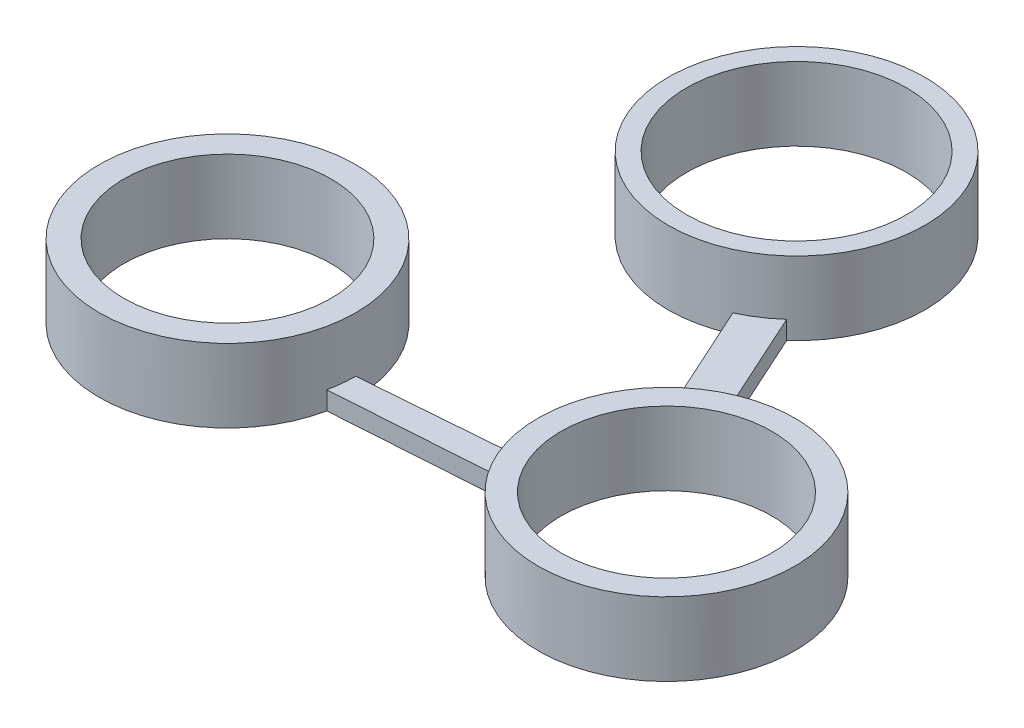
ISO-10303-21;
HEADER;
FILE_DESCRIPTION(('STEP AP214'),'2;1');
FILE_NAME('part.step','',(''),(''),'','','');
FILE_SCHEMA(('AUTOMOTIVE_DESIGN { 1 0 10303 214 1 1 1 1 }'));
ENDSEC;
DATA;
#1=APPLICATION_CONTEXT('core data for automotive mechanical design processes');
#2=APPLICATION_PROTOCOL_DEFINITION('international standard','automotive_design',2000,#1);
#3=PRODUCT_CONTEXT('',#1,'mechanical');
#4=PRODUCT('Part','Part','',(#3));
#5=PRODUCT_RELATED_PRODUCT_CATEGORY('part','',(#4));
#6=PRODUCT_DEFINITION_FORMATION('','',#4);
#7=PRODUCT_DEFINITION_CONTEXT('part definition',#1,'design');
#8=PRODUCT_DEFINITION('design','',#6,#7);
#9=PRODUCT_DEFINITION_SHAPE('','',#8);
#10=(LENGTH_UNIT() NAMED_UNIT(*) SI_UNIT(.MILLI.,.METRE.));
#11=(NAMED_UNIT(*) PLANE_ANGLE_UNIT() SI_UNIT($,.RADIAN.));
#12=(NAMED_UNIT(*) SI_UNIT($,.STERADIAN.) SOLID_ANGLE_UNIT());
#13=UNCERTAINTY_MEASURE_WITH_UNIT(LENGTH_MEASURE(1.E-05),#10,'distance_accuracy_value','');
#14=(GEOMETRIC_REPRESENTATION_CONTEXT(3) GLOBAL_UNCERTAINTY_ASSIGNED_CONTEXT((#13)) GLOBAL_UNIT_ASSIGNED_CONTEXT((#10,
#11,#12)) REPRESENTATION_CONTEXT('',''));
#15=CARTESIAN_POINT('',(0.,0.,0.));
#16=DIRECTION('',(0.,0.,1.));
#17=DIRECTION('',(1.,0.,0.));
#18=AXIS2_PLACEMENT_3D('',#15,#16,#17);
#19=CARTESIAN_POINT('',(0.,1.,0.));
#20=DIRECTION('',(0.,1.,0.));
#21=DIRECTION('',(0.,0.,1.));
#22=AXIS2_PLACEMENT_3D('',#19,#20,#21);
#23=PLANE('',#22);
#24=DIRECTION('',(-0.414033780774487,0.,-0.910261516476218));
#25=VECTOR('',#24,1.);
#26=CARTESIAN_POINT('',(-53.5880387248046,1.,-49.7512375078401));
#27=LINE('',#26,#25);
#28=CARTESIAN_POINT('',(-53.7338041530761,1.,-50.0717057062079));
#29=VERTEX_POINT('',#28);
#30=CARTESIAN_POINT('',(-57.6700518999493,1.,-58.7256248057379));
#31=VERTEX_POINT('',#30);
#32=EDGE_CURVE('E107',#29,#31,#27,.T.);
#33=ORIENTED_EDGE('',*,*,#32,.T.);
#34=CARTESIAN_POINT('',(-62.3410024051966,1.,-63.9392820036682));
#35=DIRECTION('',(0.,1.,0.));
#36=DIRECTION('',(0.,0.,1.));
#37=AXIS2_PLACEMENT_3D('',#34,#35,#36);
#38=CIRCLE('',#37,7.);
#39=CARTESIAN_POINT('',(-59.4427659397752,1.,-57.5674513883346));
#40=VERTEX_POINT('',#39);
#41=EDGE_CURVE('E101',#31,#40,#38,.F.);
#42=ORIENTED_EDGE('',*,*,#41,.T.);
#43=DIRECTION('',(0.414033780774487,0.,0.910261516476218));
#44=VECTOR('',#43,1.);
#45=CARTESIAN_POINT('',(-59.4427659397752,1.,-57.5674513883346));
#46=LINE('',#45,#44);
#47=CARTESIAN_POINT('',(-55.341606687864,1.,-48.5509710591886));
#48=VERTEX_POINT('',#47);
#49=EDGE_CURVE('E122',#40,#48,#46,.T.);
#50=ORIENTED_EDGE('',*,*,#49,.T.);
#51=CARTESIAN_POINT('',(-49.7880511189839,1.,-44.2897481662435));
#52=DIRECTION('',(0.,1.,0.));
#53=DIRECTION('',(0.,0.,1.));
#54=AXIS2_PLACEMENT_3D('',#51,#52,#53);
#55=CIRCLE('',#54,7.);
#56=EDGE_CURVE('E43',#29,#48,#55,.T.);
#57=ORIENTED_EDGE('',*,*,#56,.F.);
#58=EDGE_LOOP('',(#33,#42,#50,#57));
#59=FACE_BOUND('',#58,.T.);
#60=ADVANCED_FACE('F35',(#59),#23,.T.);
#61=CARTESIAN_POINT('',(-49.7880511189839,4.,-44.2897481662435));
#62=DIRECTION('',(0.,-1.,0.));
#63=DIRECTION('',(0.,0.,-1.));
#64=AXIS2_PLACEMENT_3D('',#61,#62,#63);
#65=CYLINDRICAL_SURFACE('',#64,7.);
#66=CARTESIAN_POINT('',(-49.7880511189839,4.,-44.2897481662435));
#67=DIRECTION('',(0.,1.,0.));
#68=DIRECTION('',(0.,0.,1.));
#69=AXIS2_PLACEMENT_3D('',#66,#67,#68);
#70=CIRCLE('',#69,7.);
#71=CARTESIAN_POINT('',(-49.7880511189839,4.,-37.2897481662435));
#72=VERTEX_POINT('',#71);
#73=EDGE_CURVE('E138',#72,#72,#70,.T.);
#74=ORIENTED_EDGE('',*,*,#73,.F.);
#75=EDGE_LOOP('',(#74));
#76=FACE_BOUND('',#75,.T.);
#77=DIRECTION('',(0.,-1.,0.));
#78=VECTOR('',#77,1.);
#79=CARTESIAN_POINT('',(-55.341606687864,1.,-48.5509710591886));
#80=LINE('',#79,#78);
#81=CARTESIAN_POINT('',(-55.341606687864,0.,-48.5509710591886));
#82=VERTEX_POINT('',#81);
#83=EDGE_CURVE('E106',#48,#82,#80,.T.);
#84=ORIENTED_EDGE('',*,*,#83,.T.);
#85=CARTESIAN_POINT('',(-49.7880511189839,0.,-44.2897481662435));
#86=DIRECTION('',(0.,1.,0.));
#87=DIRECTION('',(0.,0.,1.));
#88=AXIS2_PLACEMENT_3D('',#85,#86,#87);
#89=CIRCLE('',#88,7.);
#90=CARTESIAN_POINT('',(-56.7437684275652,0.,-45.075875842325));
#91=VERTEX_POINT('',#90);
#92=EDGE_CURVE('E135',#82,#91,#89,.T.);
#93=ORIENTED_EDGE('',*,*,#92,.T.);
#94=DIRECTION('',(0.,-1.,0.));
#95=VECTOR('',#94,1.);
#96=CARTESIAN_POINT('',(-56.7437684275652,1.,-45.075875842325));
#97=LINE('',#96,#95);
#98=CARTESIAN_POINT('',(-56.7437684275652,1.,-45.075875842325));
#99=VERTEX_POINT('',#98);
#100=EDGE_CURVE('E163',#99,#91,#97,.T.);
#101=ORIENTED_EDGE('',*,*,#100,.F.);
#102=CARTESIAN_POINT('',(-49.7880511189839,1.,-44.2897481662435));
#103=DIRECTION('',(0.,1.,0.));
#104=DIRECTION('',(0.,0.,1.));
#105=AXIS2_PLACEMENT_3D('',#102,#103,#104);
#106=CIRCLE('',#105,7.);
#107=CARTESIAN_POINT('',(-56.7478440905907,1.,-43.5405607448512));
#108=VERTEX_POINT('',#107);
#109=EDGE_CURVE('E141',#108,#99,#106,.F.);
#110=ORIENTED_EDGE('',*,*,#109,.F.);
#111=DIRECTION('',(0.,-1.,0.));
#112=VECTOR('',#111,1.);
#113=CARTESIAN_POINT('',(-56.7478440905907,4.,-43.5405607448512));
#114=LINE('',#113,#112);
#115=CARTESIAN_POINT('',(-56.7478440905907,0.,-43.5405607448512));
#116=VERTEX_POINT('',#115);
#117=EDGE_CURVE('E146',#108,#116,#114,.T.);
#118=ORIENTED_EDGE('',*,*,#117,.T.);
#119=CARTESIAN_POINT('',(-53.7338041530761,0.,-50.0717057062079));
#120=VERTEX_POINT('',#119);
#121=EDGE_CURVE('E142',#116,#120,#89,.T.);
#122=ORIENTED_EDGE('',*,*,#121,.T.);
#123=DIRECTION('',(0.,-1.,0.));
#124=VECTOR('',#123,1.);
#125=CARTESIAN_POINT('',(-53.7338041530761,4.,-50.0717057062079));
#126=LINE('',#125,#124);
#127=EDGE_CURVE('E11',#29,#120,#126,.T.);
#128=ORIENTED_EDGE('',*,*,#127,.F.);
#129=ORIENTED_EDGE('',*,*,#56,.T.);
#130=EDGE_LOOP('',(#84,#93,#101,#110,#118,#122,#128,#129));
#131=FACE_BOUND('',#130,.T.);
#132=ADVANCED_FACE('F189',(#76,#131),#65,.T.);
#133=CARTESIAN_POINT('',(-67.1134612001481,1.,-42.8420313576845));
#134=DIRECTION('',(-0.067236581299726,0.,-0.997737060620245));
#135=DIRECTION('',(-0.997737060620245,0.,0.067236581299726));
#136=AXIS2_PLACEMENT_3D('',#133,#134,#135);
#137=PLANE('',#136);
#138=ORIENTED_EDGE('',*,*,#117,.F.);
#139=DIRECTION('',(0.997737060620244,0.,-0.067236581299726));
#140=VECTOR('',#139,1.);
#141=CARTESIAN_POINT('',(-67.1134612001481,1.,-42.8420313576845));
#142=LINE('',#141,#140);
#143=CARTESIAN_POINT('',(-66.8832543703123,1.,-42.8575447838575));
#144=VERTEX_POINT('',#143);
#145=EDGE_CURVE('E149',#144,#108,#142,.T.);
#146=ORIENTED_EDGE('',*,*,#145,.F.);
#147=DIRECTION('',(0.,-1.,0.));
#148=VECTOR('',#147,1.);
#149=CARTESIAN_POINT('',(-66.8832543703123,4.,-42.8575447838575));
#150=LINE('',#149,#148);
#151=CARTESIAN_POINT('',(-66.8832543703123,0.,-42.8575447838575));
#152=VERTEX_POINT('',#151);
#153=EDGE_CURVE('E179',#144,#152,#150,.T.);
#154=ORIENTED_EDGE('',*,*,#153,.T.);
#155=DIRECTION('',(0.997737060620244,0.,-0.067236581299726));
#156=VECTOR('',#155,1.);
#157=CARTESIAN_POINT('',(-67.1134612001481,0.,-42.8420313576845));
#158=LINE('',#157,#156);
#159=EDGE_CURVE('E148',#152,#116,#158,.T.);
#160=ORIENTED_EDGE('',*,*,#159,.T.);
#161=EDGE_LOOP('',(#138,#146,#154,#160));
#162=FACE_BOUND('',#161,.T.);
#163=ADVANCED_FACE('F185',(#162),#137,.F.);
#164=CARTESIAN_POINT('',(0.,1.,0.));
#165=DIRECTION('',(0.,1.,0.));
#166=DIRECTION('',(0.,0.,1.));
#167=AXIS2_PLACEMENT_3D('',#164,#165,#166);
#168=PLANE('',#167);
#169=ORIENTED_EDGE('',*,*,#145,.T.);
#170=ORIENTED_EDGE('',*,*,#109,.T.);
#171=DIRECTION('',(-0.996918995391761,0.,0.0784379794938779));
#172=VECTOR('',#171,1.);
#173=CARTESIAN_POINT('',(-66.7351733330177,1.,-44.2897481662435));
#174=LINE('',#173,#172);
#175=CARTESIAN_POINT('',(-66.7351733330177,1.,-44.2897481662435));
#176=VERTEX_POINT('',#175);
#177=EDGE_CURVE('E152',#99,#176,#174,.T.);
#178=ORIENTED_EDGE('',*,*,#177,.T.);
#179=CARTESIAN_POINT('',(-73.7351733330177,1.,-44.2897481662435));
#180=DIRECTION('',(0.,1.,0.));
#181=DIRECTION('',(0.,0.,1.));
#182=AXIS2_PLACEMENT_3D('',#179,#180,#181);
#183=CIRCLE('',#182,7.);
#184=EDGE_CURVE('E176',#144,#176,#183,.T.);
#185=ORIENTED_EDGE('',*,*,#184,.F.);
#186=EDGE_LOOP('',(#169,#170,#178,#185));
#187=FACE_BOUND('',#186,.T.);
#188=ADVANCED_FACE('F191',(#187),#168,.T.);
#189=CARTESIAN_POINT('',(-73.7351733330177,4.,-44.2897481662435));
#190=DIRECTION('',(0.,-1.,0.));
#191=DIRECTION('',(0.,0.,-1.));
#192=AXIS2_PLACEMENT_3D('',#189,#190,#191);
#193=CYLINDRICAL_SURFACE('',#192,7.);
#194=CARTESIAN_POINT('',(-73.7351733330177,4.,-44.2897481662435));
#195=DIRECTION('',(0.,1.,0.));
#196=DIRECTION('',(0.,0.,1.));
#197=AXIS2_PLACEMENT_3D('',#194,#195,#196);
#198=CIRCLE('',#197,7.);
#199=CARTESIAN_POINT('',(-73.7351733330177,4.,-37.2897481662435));
#200=VERTEX_POINT('',#199);
#201=EDGE_CURVE('E173',#200,#200,#198,.T.);
#202=ORIENTED_EDGE('',*,*,#201,.F.);
#203=EDGE_LOOP('',(#202));
#204=FACE_BOUND('',#203,.T.);
#205=ORIENTED_EDGE('',*,*,#153,.F.);
#206=ORIENTED_EDGE('',*,*,#184,.T.);
#207=DIRECTION('',(0.,-1.,0.));
#208=VECTOR('',#207,1.);
#209=CARTESIAN_POINT('',(-66.7351733330177,1.,-44.2897481662435));
#210=LINE('',#209,#208);
#211=CARTESIAN_POINT('',(-66.7351733330177,0.,-44.2897481662435));
#212=VERTEX_POINT('',#211);
#213=EDGE_CURVE('E156',#176,#212,#210,.T.);
#214=ORIENTED_EDGE('',*,*,#213,.T.);
#215=CARTESIAN_POINT('',(-73.7351733330177,0.,-44.2897481662435));
#216=DIRECTION('',(0.,1.,0.));
#217=DIRECTION('',(0.,0.,1.));
#218=AXIS2_PLACEMENT_3D('',#215,#216,#217);
#219=CIRCLE('',#218,7.);
#220=EDGE_CURVE('E170',#212,#152,#219,.T.);
#221=ORIENTED_EDGE('',*,*,#220,.T.);
#222=EDGE_LOOP('',(#205,#206,#214,#221));
#223=FACE_BOUND('',#222,.T.);
#224=ADVANCED_FACE('F37',(#204,#223),#193,.T.);
#225=CARTESIAN_POINT('',(-73.7351733330177,4.,-44.2897481662435));
#226=DIRECTION('',(0.,1.,0.));
#227=DIRECTION('',(0.,0.,1.));
#228=AXIS2_PLACEMENT_3D('',#225,#226,#227);
#229=PLANE('',#228);
#230=ORIENTED_EDGE('',*,*,#201,.T.);
#231=EDGE_LOOP('',(#230));
#232=FACE_BOUND('',#231,.T.);
#233=CARTESIAN_POINT('',(-73.7351733330177,4.,-44.2897481662435));
#234=DIRECTION('',(0.,1.,0.));
#235=DIRECTION('',(0.,0.,1.));
#236=AXIS2_PLACEMENT_3D('',#233,#234,#235);
#237=CIRCLE('',#236,5.65000000000001);
#238=CARTESIAN_POINT('',(-73.7351733330177,4.,-38.6397481662435));
#239=VERTEX_POINT('',#238);
#240=EDGE_CURVE('E167',#239,#239,#237,.T.);
#241=ORIENTED_EDGE('',*,*,#240,.F.);
#242=EDGE_LOOP('',(#241));
#243=FACE_BOUND('',#242,.T.);
#244=ADVANCED_FACE('F255',(#232,#243),#229,.T.);
#245=CARTESIAN_POINT('',(-73.7351733330177,0.,-44.2897481662435));
#246=DIRECTION('',(0.,1.,0.));
#247=DIRECTION('',(0.,0.,1.));
#248=AXIS2_PLACEMENT_3D('',#245,#246,#247);
#249=PLANE('',#248);
#250=CARTESIAN_POINT('',(-62.3410024051966,0.,-63.9392820036682));
#251=DIRECTION('',(0.,1.,0.));
#252=DIRECTION('',(0.,0.,1.));
#253=AXIS2_PLACEMENT_3D('',#250,#251,#252);
#254=CIRCLE('',#253,7.);
#255=CARTESIAN_POINT('',(-57.6700518999493,0.,-58.7256248057379));
#256=VERTEX_POINT('',#255);
#257=CARTESIAN_POINT('',(-59.4427659397752,0.,-57.5674513883346));
#258=VERTEX_POINT('',#257);
#259=EDGE_CURVE('E98',#256,#258,#254,.T.);
#260=ORIENTED_EDGE('',*,*,#259,.F.);
#261=DIRECTION('',(-0.414033780774487,0.,-0.910261516476218));
#262=VECTOR('',#261,1.);
#263=CARTESIAN_POINT('',(-53.5880387248046,0.,-49.7512375078401));
#264=LINE('',#263,#262);
#265=EDGE_CURVE('E114',#120,#256,#264,.T.);
#266=ORIENTED_EDGE('',*,*,#265,.F.);
#267=ORIENTED_EDGE('',*,*,#121,.F.);
#268=ORIENTED_EDGE('',*,*,#159,.F.);
#269=ORIENTED_EDGE('',*,*,#220,.F.);
#270=DIRECTION('',(-0.996918995391761,0.,0.0784379794938779));
#271=VECTOR('',#270,1.);
#272=CARTESIAN_POINT('',(-66.7351733330177,0.,-44.2897481662435));
#273=LINE('',#272,#271);
#274=EDGE_CURVE('E153',#91,#212,#273,.T.);
#275=ORIENTED_EDGE('',*,*,#274,.F.);
#276=ORIENTED_EDGE('',*,*,#92,.F.);
#277=DIRECTION('',(0.414033780774487,0.,0.910261516476218));
#278=VECTOR('',#277,1.);
#279=CARTESIAN_POINT('',(-59.4427659397752,0.,-57.5674513883346));
#280=LINE('',#279,#278);
#281=EDGE_CURVE('E116',#258,#82,#280,.T.);
#282=ORIENTED_EDGE('',*,*,#281,.F.);
#283=EDGE_LOOP('',(#260,#266,#267,#268,#269,#275,#276,#282));
#284=FACE_BOUND('',#283,.T.);
#285=CARTESIAN_POINT('',(-62.3410024051966,0.,-63.9392820036682));
#286=DIRECTION('',(0.,1.,0.));
#287=DIRECTION('',(0.,0.,1.));
#288=AXIS2_PLACEMENT_3D('',#285,#286,#287);
#289=CIRCLE('',#288,6.);
#290=CARTESIAN_POINT('',(-62.3410024051966,0.,-57.9392820036682));
#291=VERTEX_POINT('',#290);
#292=EDGE_CURVE('E205',#291,#291,#289,.T.);
#293=ORIENTED_EDGE('',*,*,#292,.T.);
#294=EDGE_LOOP('',(#293));
#295=FACE_BOUND('',#294,.T.);
#296=CARTESIAN_POINT('',(-49.7880511189839,0.,-44.2897481662435));
#297=DIRECTION('',(0.,1.,0.));
#298=DIRECTION('',(0.,0.,1.));
#299=AXIS2_PLACEMENT_3D('',#296,#297,#298);
#300=CIRCLE('',#299,5.74999999999999);
#301=CARTESIAN_POINT('',(-49.7880511189839,0.,-38.5397481662435));
#302=VERTEX_POINT('',#301);
#303=EDGE_CURVE('E131',#302,#302,#300,.T.);
#304=ORIENTED_EDGE('',*,*,#303,.T.);
#305=EDGE_LOOP('',(#304));
#306=FACE_BOUND('',#305,.T.);
#307=CARTESIAN_POINT('',(-73.7351733330177,0.,-44.2897481662435));
#308=DIRECTION('',(0.,1.,0.));
#309=DIRECTION('',(0.,0.,1.));
#310=AXIS2_PLACEMENT_3D('',#307,#308,#309);
#311=CIRCLE('',#310,5.65000000000001);
#312=CARTESIAN_POINT('',(-73.7351733330177,0.,-38.6397481662435));
#313=VERTEX_POINT('',#312);
#314=EDGE_CURVE('E166',#313,#313,#311,.T.);
#315=ORIENTED_EDGE('',*,*,#314,.T.);
#316=EDGE_LOOP('',(#315));
#317=FACE_BOUND('',#316,.T.);
#318=ADVANCED_FACE('F111',(#284,#295,#306,#317),#249,.F.);
#319=CARTESIAN_POINT('',(-73.7351733330177,4.,-44.2897481662435));
#320=DIRECTION('',(0.,-1.,0.));
#321=DIRECTION('',(0.,0.,-1.));
#322=AXIS2_PLACEMENT_3D('',#319,#320,#321);
#323=CYLINDRICAL_SURFACE('',#322,5.65000000000001);
#324=ORIENTED_EDGE('',*,*,#240,.T.);
#325=EDGE_LOOP('',(#324));
#326=FACE_BOUND('',#325,.T.);
#327=ORIENTED_EDGE('',*,*,#314,.F.);
#328=EDGE_LOOP('',(#327));
#329=FACE_BOUND('',#328,.T.);
#330=ADVANCED_FACE('F249',(#326,#329),#323,.F.);
#331=CARTESIAN_POINT('',(-66.7351733330177,1.,-44.2897481662435));
#332=DIRECTION('',(0.0784379794938779,0.,0.996918995391761));
#333=DIRECTION('',(0.996918995391761,0.,-0.0784379794938779));
#334=AXIS2_PLACEMENT_3D('',#331,#332,#333);
#335=PLANE('',#334);
#336=ORIENTED_EDGE('',*,*,#274,.T.);
#337=ORIENTED_EDGE('',*,*,#213,.F.);
#338=ORIENTED_EDGE('',*,*,#177,.F.);
#339=ORIENTED_EDGE('',*,*,#100,.T.);
#340=EDGE_LOOP('',(#336,#337,#338,#339));
#341=FACE_BOUND('',#340,.T.);
#342=ADVANCED_FACE('F195',(#341),#335,.F.);
#343=CARTESIAN_POINT('',(-49.7880511189839,4.,-44.2897481662435));
#344=DIRECTION('',(0.,1.,0.));
#345=DIRECTION('',(0.,0.,1.));
#346=AXIS2_PLACEMENT_3D('',#343,#344,#345);
#347=PLANE('',#346);
#348=ORIENTED_EDGE('',*,*,#73,.T.);
#349=EDGE_LOOP('',(#348));
#350=FACE_BOUND('',#349,.T.);
#351=CARTESIAN_POINT('',(-49.7880511189839,4.,-44.2897481662435));
#352=DIRECTION('',(0.,1.,0.));
#353=DIRECTION('',(0.,0.,1.));
#354=AXIS2_PLACEMENT_3D('',#351,#352,#353);
#355=CIRCLE('',#354,5.74999999999999);
#356=CARTESIAN_POINT('',(-49.7880511189839,4.,-38.5397481662435));
#357=VERTEX_POINT('',#356);
#358=EDGE_CURVE('E132',#357,#357,#355,.T.);
#359=ORIENTED_EDGE('',*,*,#358,.F.);
#360=EDGE_LOOP('',(#359));
#361=FACE_BOUND('',#360,.T.);
#362=ADVANCED_FACE('F240',(#350,#361),#347,.T.);
#363=CARTESIAN_POINT('',(-49.7880511189839,4.,-44.2897481662435));
#364=DIRECTION('',(0.,-1.,0.));
#365=DIRECTION('',(0.,0.,-1.));
#366=AXIS2_PLACEMENT_3D('',#363,#364,#365);
#367=CYLINDRICAL_SURFACE('',#366,5.74999999999999);
#368=ORIENTED_EDGE('',*,*,#358,.T.);
#369=EDGE_LOOP('',(#368));
#370=FACE_BOUND('',#369,.T.);
#371=ORIENTED_EDGE('',*,*,#303,.F.);
#372=EDGE_LOOP('',(#371));
#373=FACE_BOUND('',#372,.T.);
#374=ADVANCED_FACE('F235',(#370,#373),#367,.F.);
#375=CARTESIAN_POINT('',(-53.5880387248046,1.,-49.7512375078401));
#376=DIRECTION('',(-0.910261516476218,0.,0.414033780774487));
#377=DIRECTION('',(0.414033780774487,0.,0.910261516476218));
#378=AXIS2_PLACEMENT_3D('',#375,#376,#377);
#379=PLANE('',#378);
#380=ORIENTED_EDGE('',*,*,#32,.F.);
#381=ORIENTED_EDGE('',*,*,#127,.T.);
#382=ORIENTED_EDGE('',*,*,#265,.T.);
#383=DIRECTION('',(0.,-1.,0.));
#384=VECTOR('',#383,1.);
#385=CARTESIAN_POINT('',(-57.6700518999493,1.,-58.7256248057379));
#386=LINE('',#385,#384);
#387=EDGE_CURVE('E95',#31,#256,#386,.T.);
#388=ORIENTED_EDGE('',*,*,#387,.F.);
#389=EDGE_LOOP('',(#380,#381,#382,#388));
#390=FACE_BOUND('',#389,.T.);
#391=ADVANCED_FACE('F121',(#390),#379,.F.);
#392=CARTESIAN_POINT('',(-59.4427659397752,1.,-57.5674513883346));
#393=DIRECTION('',(0.910261516476218,0.,-0.414033780774487));
#394=DIRECTION('',(-0.414033780774487,0.,-0.910261516476218));
#395=AXIS2_PLACEMENT_3D('',#392,#393,#394);
#396=PLANE('',#395);
#397=ORIENTED_EDGE('',*,*,#281,.T.);
#398=ORIENTED_EDGE('',*,*,#83,.F.);
#399=ORIENTED_EDGE('',*,*,#49,.F.);
#400=DIRECTION('',(0.,-1.,0.));
#401=VECTOR('',#400,1.);
#402=CARTESIAN_POINT('',(-59.4427659397752,1.,-57.5674513883346));
#403=LINE('',#402,#401);
#404=EDGE_CURVE('E129',#40,#258,#403,.T.);
#405=ORIENTED_EDGE('',*,*,#404,.T.);
#406=EDGE_LOOP('',(#397,#398,#399,#405));
#407=FACE_BOUND('',#406,.T.);
#408=ADVANCED_FACE('F199',(#407),#396,.F.);
#409=CARTESIAN_POINT('',(-62.3410024051966,4.,-63.9392820036682));
#410=DIRECTION('',(0.,-1.,0.));
#411=DIRECTION('',(0.,0.,-1.));
#412=AXIS2_PLACEMENT_3D('',#409,#410,#411);
#413=CYLINDRICAL_SURFACE('',#412,7.);
#414=CARTESIAN_POINT('',(-62.3410024051966,4.,-63.9392820036682));
#415=DIRECTION('',(0.,1.,0.));
#416=DIRECTION('',(0.,0.,1.));
#417=AXIS2_PLACEMENT_3D('',#414,#415,#416);
#418=CIRCLE('',#417,7.);
#419=CARTESIAN_POINT('',(-62.3410024051966,4.,-56.9392820036682));
#420=VERTEX_POINT('',#419);
#421=EDGE_CURVE('E118',#420,#420,#418,.T.);
#422=ORIENTED_EDGE('',*,*,#421,.F.);
#423=EDGE_LOOP('',(#422));
#424=FACE_BOUND('',#423,.T.);
#425=ORIENTED_EDGE('',*,*,#41,.F.);
#426=ORIENTED_EDGE('',*,*,#387,.T.);
#427=ORIENTED_EDGE('',*,*,#259,.T.);
#428=ORIENTED_EDGE('',*,*,#404,.F.);
#429=EDGE_LOOP('',(#425,#426,#427,#428));
#430=FACE_BOUND('',#429,.T.);
#431=ADVANCED_FACE('F97',(#424,#430),#413,.T.);
#432=CARTESIAN_POINT('',(-62.3410024051966,4.,-63.9392820036682));
#433=DIRECTION('',(0.,1.,0.));
#434=DIRECTION('',(0.,0.,1.));
#435=AXIS2_PLACEMENT_3D('',#432,#433,#434);
#436=PLANE('',#435);
#437=ORIENTED_EDGE('',*,*,#421,.T.);
#438=EDGE_LOOP('',(#437));
#439=FACE_BOUND('',#438,.T.);
#440=CARTESIAN_POINT('',(-62.3410024051966,4.,-63.9392820036682));
#441=DIRECTION('',(0.,1.,0.));
#442=DIRECTION('',(0.,0.,1.));
#443=AXIS2_PLACEMENT_3D('',#440,#441,#442);
#444=CIRCLE('',#443,6.);
#445=CARTESIAN_POINT('',(-62.3410024051966,4.,-57.9392820036682));
#446=VERTEX_POINT('',#445);
#447=EDGE_CURVE('E119',#446,#446,#444,.T.);
#448=ORIENTED_EDGE('',*,*,#447,.F.);
#449=EDGE_LOOP('',(#448));
#450=FACE_BOUND('',#449,.T.);
#451=ADVANCED_FACE('F214',(#439,#450),#436,.T.);
#452=CARTESIAN_POINT('',(-62.3410024051966,4.,-63.9392820036682));
#453=DIRECTION('',(0.,-1.,0.));
#454=DIRECTION('',(0.,0.,-1.));
#455=AXIS2_PLACEMENT_3D('',#452,#453,#454);
#456=CYLINDRICAL_SURFACE('',#455,6.);
#457=ORIENTED_EDGE('',*,*,#447,.T.);
#458=EDGE_LOOP('',(#457));
#459=FACE_BOUND('',#458,.T.);
#460=ORIENTED_EDGE('',*,*,#292,.F.);
#461=EDGE_LOOP('',(#460));
#462=FACE_BOUND('',#461,.T.);
#463=ADVANCED_FACE('F211',(#459,#462),#456,.F.);
#464=CLOSED_SHELL('',(#60,#132,#163,#188,#224,#244,#318,#330,#342,#362,#374,#391,#408,#431,#451,#463));
#465=MANIFOLD_SOLID_BREP('B2',#464);
#466=ADVANCED_BREP_SHAPE_REPRESENTATION('',(#18,#465),#14);
#467=SHAPE_DEFINITION_REPRESENTATION(#9,#466);
ENDSEC;
END-ISO-10303-21;
